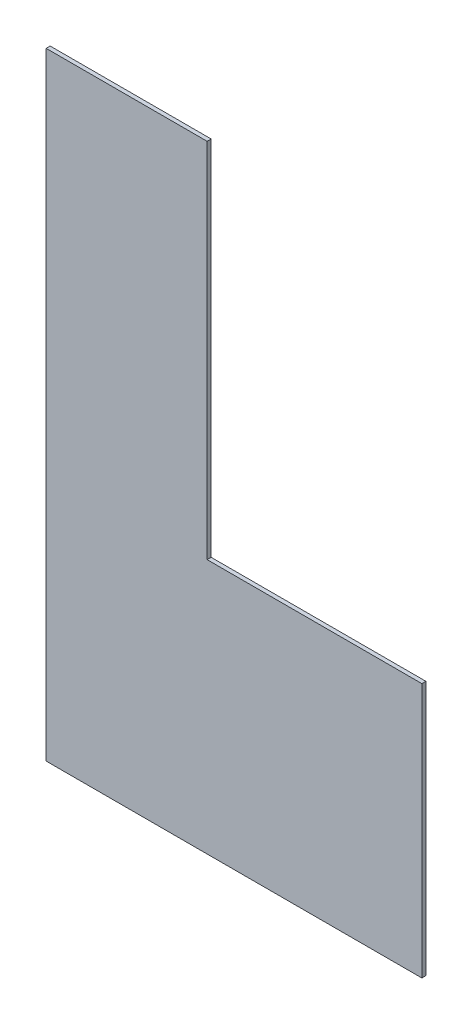
ISO-10303-21;
HEADER;
FILE_DESCRIPTION(('STEP AP214'),'2;1');
FILE_NAME('part.step','',(''),(''),'','','');
FILE_SCHEMA(('AUTOMOTIVE_DESIGN { 1 0 10303 214 1 1 1 1 }'));
ENDSEC;
DATA;
#1=APPLICATION_CONTEXT('core data for automotive mechanical design processes');
#2=APPLICATION_PROTOCOL_DEFINITION('international standard','automotive_design',2000,#1);
#3=PRODUCT_CONTEXT('',#1,'mechanical');
#4=PRODUCT('Part','Part','',(#3));
#5=PRODUCT_RELATED_PRODUCT_CATEGORY('part','',(#4));
#6=PRODUCT_DEFINITION_FORMATION('','',#4);
#7=PRODUCT_DEFINITION_CONTEXT('part definition',#1,'design');
#8=PRODUCT_DEFINITION('design','',#6,#7);
#9=PRODUCT_DEFINITION_SHAPE('','',#8);
#10=(LENGTH_UNIT() NAMED_UNIT(*) SI_UNIT(.MILLI.,.METRE.));
#11=(NAMED_UNIT(*) PLANE_ANGLE_UNIT() SI_UNIT($,.RADIAN.));
#12=(NAMED_UNIT(*) SI_UNIT($,.STERADIAN.) SOLID_ANGLE_UNIT());
#13=UNCERTAINTY_MEASURE_WITH_UNIT(LENGTH_MEASURE(1.E-05),#10,'distance_accuracy_value','');
#14=(GEOMETRIC_REPRESENTATION_CONTEXT(3) GLOBAL_UNCERTAINTY_ASSIGNED_CONTEXT((#13)) GLOBAL_UNIT_ASSIGNED_CONTEXT((#10,
#11,#12)) REPRESENTATION_CONTEXT('',''));
#15=CARTESIAN_POINT('',(0.,0.,0.));
#16=DIRECTION('',(0.,0.,1.));
#17=DIRECTION('',(1.,0.,0.));
#18=AXIS2_PLACEMENT_3D('',#15,#16,#17);
#19=CARTESIAN_POINT('',(-158.414514074945,51.3285358571626,3.));
#20=DIRECTION('',(1.,0.,0.));
#21=DIRECTION('',(0.,1.,0.));
#22=AXIS2_PLACEMENT_3D('',#19,#20,#21);
#23=PLANE('',#22);
#24=DIRECTION('',(0.,-1.,0.));
#25=VECTOR('',#24,1.);
#26=CARTESIAN_POINT('',(-158.414514074945,51.3285358571626,0.));
#27=LINE('',#26,#25);
#28=CARTESIAN_POINT('',(-158.414514074945,51.3285358571626,0.));
#29=VERTEX_POINT('',#28);
#30=CARTESIAN_POINT('',(-158.414514074945,-408.671464142837,0.));
#31=VERTEX_POINT('',#30);
#32=EDGE_CURVE('E117',#29,#31,#27,.T.);
#33=ORIENTED_EDGE('',*,*,#32,.T.);
#34=DIRECTION('',(0.,0.,-1.));
#35=VECTOR('',#34,1.);
#36=CARTESIAN_POINT('',(-158.414514074945,-408.671464142837,3.));
#37=LINE('',#36,#35);
#38=CARTESIAN_POINT('',(-158.414514074945,-408.671464142837,3.));
#39=VERTEX_POINT('',#38);
#40=EDGE_CURVE('E11',#39,#31,#37,.T.);
#41=ORIENTED_EDGE('',*,*,#40,.F.);
#42=DIRECTION('',(0.,-1.,0.));
#43=VECTOR('',#42,1.);
#44=CARTESIAN_POINT('',(-158.414514074945,51.3285358571626,3.));
#45=LINE('',#44,#43);
#46=CARTESIAN_POINT('',(-158.414514074945,51.3285358571626,3.));
#47=VERTEX_POINT('',#46);
#48=EDGE_CURVE('E127',#47,#39,#45,.T.);
#49=ORIENTED_EDGE('',*,*,#48,.F.);
#50=DIRECTION('',(0.,0.,-1.));
#51=VECTOR('',#50,1.);
#52=CARTESIAN_POINT('',(-158.414514074945,51.3285358571626,3.));
#53=LINE('',#52,#51);
#54=EDGE_CURVE('E113',#47,#29,#53,.T.);
#55=ORIENTED_EDGE('',*,*,#54,.T.);
#56=EDGE_LOOP('',(#33,#41,#49,#55));
#57=FACE_BOUND('',#56,.T.);
#58=ADVANCED_FACE('F33',(#57),#23,.F.);
#59=CARTESIAN_POINT('',(-158.414514074945,-408.671464142837,3.));
#60=DIRECTION('',(0.,1.,0.));
#61=DIRECTION('',(0.,0.,1.));
#62=AXIS2_PLACEMENT_3D('',#59,#60,#61);
#63=PLANE('',#62);
#64=DIRECTION('',(1.,0.,0.));
#65=VECTOR('',#64,1.);
#66=CARTESIAN_POINT('',(-158.414514074945,-408.671464142837,0.));
#67=LINE('',#66,#65);
#68=CARTESIAN_POINT('',(121.585485925055,-408.671464142837,0.));
#69=VERTEX_POINT('',#68);
#70=EDGE_CURVE('E120',#31,#69,#67,.T.);
#71=ORIENTED_EDGE('',*,*,#70,.T.);
#72=DIRECTION('',(0.,0.,-1.));
#73=VECTOR('',#72,1.);
#74=CARTESIAN_POINT('',(121.585485925055,-408.671464142837,3.));
#75=LINE('',#74,#73);
#76=CARTESIAN_POINT('',(121.585485925055,-408.671464142837,3.));
#77=VERTEX_POINT('',#76);
#78=EDGE_CURVE('E41',#77,#69,#75,.T.);
#79=ORIENTED_EDGE('',*,*,#78,.F.);
#80=DIRECTION('',(1.,0.,0.));
#81=VECTOR('',#80,1.);
#82=CARTESIAN_POINT('',(-158.414514074945,-408.671464142837,3.));
#83=LINE('',#82,#81);
#84=EDGE_CURVE('E86',#39,#77,#83,.T.);
#85=ORIENTED_EDGE('',*,*,#84,.F.);
#86=ORIENTED_EDGE('',*,*,#40,.T.);
#87=EDGE_LOOP('',(#71,#79,#85,#86));
#88=FACE_BOUND('',#87,.T.);
#89=ADVANCED_FACE('F151',(#88),#63,.F.);
#90=CARTESIAN_POINT('',(121.585485925055,-218.671464142837,3.));
#91=DIRECTION('',(-1.,0.,0.));
#92=DIRECTION('',(0.,-1.,0.));
#93=AXIS2_PLACEMENT_3D('',#90,#91,#92);
#94=PLANE('',#93);
#95=DIRECTION('',(0.,1.,0.));
#96=VECTOR('',#95,1.);
#97=CARTESIAN_POINT('',(121.585485925055,-218.671464142837,0.));
#98=LINE('',#97,#96);
#99=CARTESIAN_POINT('',(121.585485925055,-218.671464142837,0.));
#100=VERTEX_POINT('',#99);
#101=EDGE_CURVE('E122',#69,#100,#98,.T.);
#102=ORIENTED_EDGE('',*,*,#101,.T.);
#103=DIRECTION('',(0.,0.,-1.));
#104=VECTOR('',#103,1.);
#105=CARTESIAN_POINT('',(121.585485925055,-218.671464142837,3.));
#106=LINE('',#105,#104);
#107=CARTESIAN_POINT('',(121.585485925055,-218.671464142837,3.));
#108=VERTEX_POINT('',#107);
#109=EDGE_CURVE('E108',#108,#100,#106,.T.);
#110=ORIENTED_EDGE('',*,*,#109,.F.);
#111=DIRECTION('',(0.,1.,0.));
#112=VECTOR('',#111,1.);
#113=CARTESIAN_POINT('',(121.585485925055,-218.671464142837,3.));
#114=LINE('',#113,#112);
#115=EDGE_CURVE('E99',#77,#108,#114,.T.);
#116=ORIENTED_EDGE('',*,*,#115,.F.);
#117=ORIENTED_EDGE('',*,*,#78,.T.);
#118=EDGE_LOOP('',(#102,#110,#116,#117));
#119=FACE_BOUND('',#118,.T.);
#120=ADVANCED_FACE('F133',(#119),#94,.F.);
#121=CARTESIAN_POINT('',(-38.4145140749447,-218.671464142837,3.));
#122=DIRECTION('',(0.,-1.,0.));
#123=DIRECTION('',(0.,0.,-1.));
#124=AXIS2_PLACEMENT_3D('',#121,#122,#123);
#125=PLANE('',#124);
#126=DIRECTION('',(-1.,0.,0.));
#127=VECTOR('',#126,1.);
#128=CARTESIAN_POINT('',(-38.4145140749447,-218.671464142837,0.));
#129=LINE('',#128,#127);
#130=CARTESIAN_POINT('',(-38.4145140749447,-218.671464142837,0.));
#131=VERTEX_POINT('',#130);
#132=EDGE_CURVE('E107',#100,#131,#129,.T.);
#133=ORIENTED_EDGE('',*,*,#132,.T.);
#134=DIRECTION('',(0.,0.,-1.));
#135=VECTOR('',#134,1.);
#136=CARTESIAN_POINT('',(-38.4145140749447,-218.671464142837,3.));
#137=LINE('',#136,#135);
#138=CARTESIAN_POINT('',(-38.4145140749447,-218.671464142837,3.));
#139=VERTEX_POINT('',#138);
#140=EDGE_CURVE('E104',#139,#131,#137,.T.);
#141=ORIENTED_EDGE('',*,*,#140,.F.);
#142=DIRECTION('',(-1.,0.,0.));
#143=VECTOR('',#142,1.);
#144=CARTESIAN_POINT('',(-38.4145140749447,-218.671464142837,3.));
#145=LINE('',#144,#143);
#146=EDGE_CURVE('E93',#108,#139,#145,.T.);
#147=ORIENTED_EDGE('',*,*,#146,.F.);
#148=ORIENTED_EDGE('',*,*,#109,.T.);
#149=EDGE_LOOP('',(#133,#141,#147,#148));
#150=FACE_BOUND('',#149,.T.);
#151=ADVANCED_FACE('F105',(#150),#125,.F.);
#152=CARTESIAN_POINT('',(-38.4145140749447,51.3285358571626,3.));
#153=DIRECTION('',(-1.,0.,0.));
#154=DIRECTION('',(0.,-1.,0.));
#155=AXIS2_PLACEMENT_3D('',#152,#153,#154);
#156=PLANE('',#155);
#157=DIRECTION('',(0.,1.,0.));
#158=VECTOR('',#157,1.);
#159=CARTESIAN_POINT('',(-38.4145140749447,51.3285358571626,0.));
#160=LINE('',#159,#158);
#161=CARTESIAN_POINT('',(-38.4145140749447,51.3285358571626,0.));
#162=VERTEX_POINT('',#161);
#163=EDGE_CURVE('E72',#131,#162,#160,.T.);
#164=ORIENTED_EDGE('',*,*,#163,.T.);
#165=DIRECTION('',(0.,0.,-1.));
#166=VECTOR('',#165,1.);
#167=CARTESIAN_POINT('',(-38.4145140749447,51.3285358571626,3.));
#168=LINE('',#167,#166);
#169=CARTESIAN_POINT('',(-38.4145140749447,51.3285358571626,3.));
#170=VERTEX_POINT('',#169);
#171=EDGE_CURVE('E109',#170,#162,#168,.T.);
#172=ORIENTED_EDGE('',*,*,#171,.F.);
#173=DIRECTION('',(0.,1.,0.));
#174=VECTOR('',#173,1.);
#175=CARTESIAN_POINT('',(-38.4145140749447,51.3285358571626,3.));
#176=LINE('',#175,#174);
#177=EDGE_CURVE('E97',#139,#170,#176,.T.);
#178=ORIENTED_EDGE('',*,*,#177,.F.);
#179=ORIENTED_EDGE('',*,*,#140,.T.);
#180=EDGE_LOOP('',(#164,#172,#178,#179));
#181=FACE_BOUND('',#180,.T.);
#182=ADVANCED_FACE('F111',(#181),#156,.F.);
#183=CARTESIAN_POINT('',(-158.414514074945,51.3285358571626,3.));
#184=DIRECTION('',(0.,-1.,0.));
#185=DIRECTION('',(0.,0.,-1.));
#186=AXIS2_PLACEMENT_3D('',#183,#184,#185);
#187=PLANE('',#186);
#188=DIRECTION('',(-1.,0.,0.));
#189=VECTOR('',#188,1.);
#190=CARTESIAN_POINT('',(-158.414514074945,51.3285358571626,0.));
#191=LINE('',#190,#189);
#192=EDGE_CURVE('E78',#162,#29,#191,.T.);
#193=ORIENTED_EDGE('',*,*,#192,.T.);
#194=ORIENTED_EDGE('',*,*,#54,.F.);
#195=DIRECTION('',(-1.,0.,0.));
#196=VECTOR('',#195,1.);
#197=CARTESIAN_POINT('',(-158.414514074945,51.3285358571626,3.));
#198=LINE('',#197,#196);
#199=EDGE_CURVE('E49',#170,#47,#198,.T.);
#200=ORIENTED_EDGE('',*,*,#199,.F.);
#201=ORIENTED_EDGE('',*,*,#171,.T.);
#202=EDGE_LOOP('',(#193,#194,#200,#201));
#203=FACE_BOUND('',#202,.T.);
#204=ADVANCED_FACE('F140',(#203),#187,.F.);
#205=CARTESIAN_POINT('',(0.,0.,3.));
#206=DIRECTION('',(0.,0.,1.));
#207=DIRECTION('',(1.,0.,0.));
#208=AXIS2_PLACEMENT_3D('',#205,#206,#207);
#209=PLANE('',#208);
#210=ORIENTED_EDGE('',*,*,#48,.T.);
#211=ORIENTED_EDGE('',*,*,#84,.T.);
#212=ORIENTED_EDGE('',*,*,#115,.T.);
#213=ORIENTED_EDGE('',*,*,#146,.T.);
#214=ORIENTED_EDGE('',*,*,#177,.T.);
#215=ORIENTED_EDGE('',*,*,#199,.T.);
#216=EDGE_LOOP('',(#210,#211,#212,#213,#214,#215));
#217=FACE_BOUND('',#216,.T.);
#218=ADVANCED_FACE('F95',(#217),#209,.T.);
#219=CARTESIAN_POINT('',(0.,0.,0.));
#220=DIRECTION('',(0.,0.,1.));
#221=DIRECTION('',(1.,0.,0.));
#222=AXIS2_PLACEMENT_3D('',#219,#220,#221);
#223=PLANE('',#222);
#224=ORIENTED_EDGE('',*,*,#32,.F.);
#225=ORIENTED_EDGE('',*,*,#192,.F.);
#226=ORIENTED_EDGE('',*,*,#163,.F.);
#227=ORIENTED_EDGE('',*,*,#132,.F.);
#228=ORIENTED_EDGE('',*,*,#101,.F.);
#229=ORIENTED_EDGE('',*,*,#70,.F.);
#230=EDGE_LOOP('',(#224,#225,#226,#227,#228,#229));
#231=FACE_BOUND('',#230,.T.);
#232=ADVANCED_FACE('F136',(#231),#223,.F.);
#233=CLOSED_SHELL('',(#58,#89,#120,#151,#182,#204,#218,#232));
#234=MANIFOLD_SOLID_BREP('B2',#233);
#235=ADVANCED_BREP_SHAPE_REPRESENTATION('',(#18,#234),#14);
#236=SHAPE_DEFINITION_REPRESENTATION(#9,#235);
ENDSEC;
END-ISO-10303-21;
